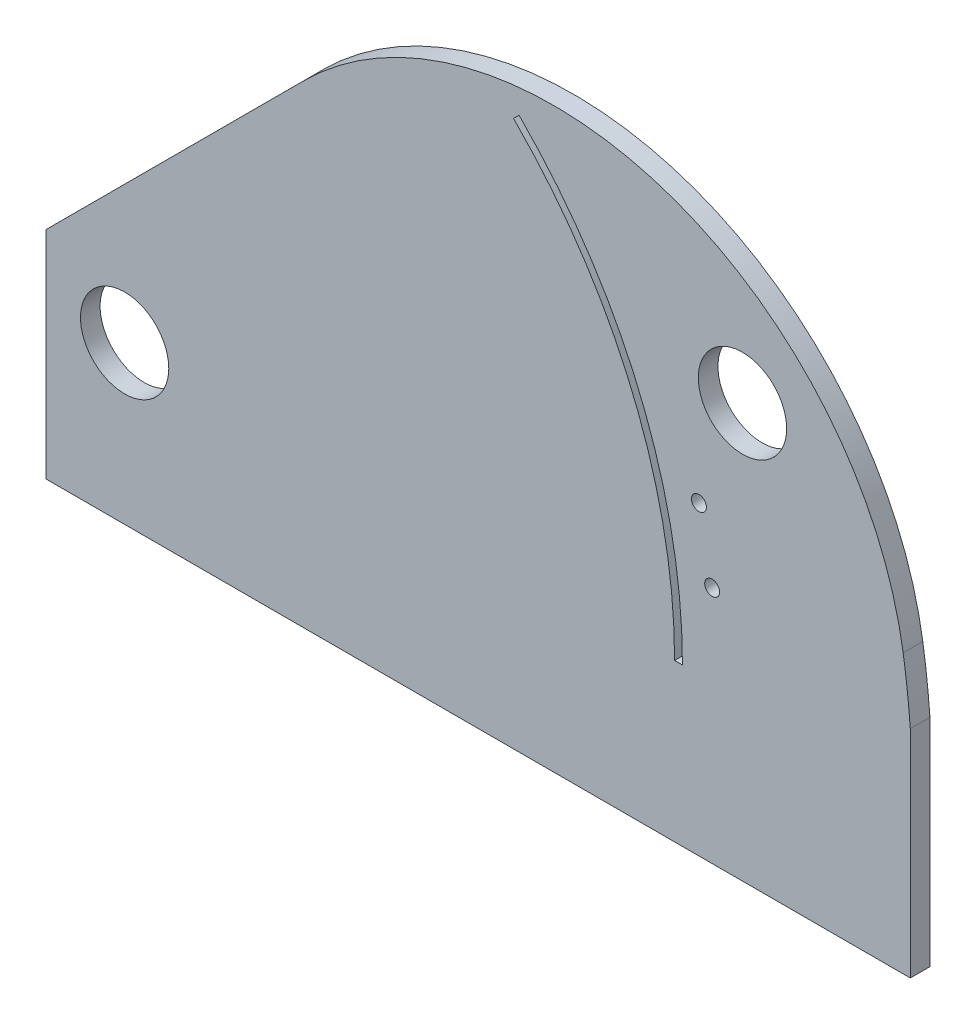
ISO-10303-21;
HEADER;
FILE_DESCRIPTION(('STEP AP214'),'2;1');
FILE_NAME('part.step','',(''),(''),'','','');
FILE_SCHEMA(('AUTOMOTIVE_DESIGN { 1 0 10303 214 1 1 1 1 }'));
ENDSEC;
DATA;
#1=APPLICATION_CONTEXT('core data for automotive mechanical design processes');
#2=APPLICATION_PROTOCOL_DEFINITION('international standard','automotive_design',2000,#1);
#3=PRODUCT_CONTEXT('',#1,'mechanical');
#4=PRODUCT('Part','Part','',(#3));
#5=PRODUCT_RELATED_PRODUCT_CATEGORY('part','',(#4));
#6=PRODUCT_DEFINITION_FORMATION('','',#4);
#7=PRODUCT_DEFINITION_CONTEXT('part definition',#1,'design');
#8=PRODUCT_DEFINITION('design','',#6,#7);
#9=PRODUCT_DEFINITION_SHAPE('','',#8);
#10=(LENGTH_UNIT() NAMED_UNIT(*) SI_UNIT(.MILLI.,.METRE.));
#11=(NAMED_UNIT(*) PLANE_ANGLE_UNIT() SI_UNIT($,.RADIAN.));
#12=(NAMED_UNIT(*) SI_UNIT($,.STERADIAN.) SOLID_ANGLE_UNIT());
#13=UNCERTAINTY_MEASURE_WITH_UNIT(LENGTH_MEASURE(1.E-05),#10,'distance_accuracy_value','');
#14=(GEOMETRIC_REPRESENTATION_CONTEXT(3) GLOBAL_UNCERTAINTY_ASSIGNED_CONTEXT((#13)) GLOBAL_UNIT_ASSIGNED_CONTEXT((#10,
#11,#12)) REPRESENTATION_CONTEXT('',''));
#15=CARTESIAN_POINT('',(0.,0.,0.));
#16=DIRECTION('',(0.,0.,1.));
#17=DIRECTION('',(1.,0.,0.));
#18=AXIS2_PLACEMENT_3D('',#15,#16,#17);
#19=CARTESIAN_POINT('',(0.,0.,6.35));
#20=DIRECTION('',(0.,0.,1.));
#21=DIRECTION('',(1.,0.,0.));
#22=AXIS2_PLACEMENT_3D('',#19,#20,#21);
#23=PLANE('',#22);
#24=CARTESIAN_POINT('',(185.66167299531,48.0153733775204,6.35));
#25=DIRECTION('',(0.,0.,1.));
#26=DIRECTION('',(1.,0.,0.));
#27=AXIS2_PLACEMENT_3D('',#24,#25,#26);
#28=CIRCLE('',#27,2.41299999999999);
#29=CARTESIAN_POINT('',(188.07467299531,48.0153733775204,6.35));
#30=VERTEX_POINT('',#29);
#31=EDGE_CURVE('E424',#30,#30,#28,.T.);
#32=ORIENTED_EDGE('',*,*,#31,.F.);
#33=EDGE_LOOP('',(#32));
#34=FACE_BOUND('',#33,.T.);
#35=CARTESIAN_POINT('',(189.940787605847,26.4240440445931,6.35));
#36=DIRECTION('',(0.,0.,1.));
#37=DIRECTION('',(1.,0.,0.));
#38=AXIS2_PLACEMENT_3D('',#35,#36,#37);
#39=CIRCLE('',#38,2.413);
#40=CARTESIAN_POINT('',(192.353787605847,26.4240440445931,6.35));
#41=VERTEX_POINT('',#40);
#42=EDGE_CURVE('E410',#41,#41,#39,.T.);
#43=ORIENTED_EDGE('',*,*,#42,.F.);
#44=EDGE_LOOP('',(#43));
#45=FACE_BOUND('',#44,.T.);
#46=CARTESIAN_POINT('',(199.741193703078,83.0049467119255,6.35));
#47=DIRECTION('',(0.,0.,1.));
#48=DIRECTION('',(1.,0.,0.));
#49=AXIS2_PLACEMENT_3D('',#46,#47,#48);
#50=CIRCLE('',#49,14.2748);
#51=CARTESIAN_POINT('',(214.015993703078,83.0049467119255,6.35));
#52=VERTEX_POINT('',#51);
#53=EDGE_CURVE('E157',#52,#52,#50,.T.);
#54=ORIENTED_EDGE('',*,*,#53,.F.);
#55=EDGE_LOOP('',(#54));
#56=FACE_BOUND('',#55,.T.);
#57=CARTESIAN_POINT('',(0.,0.,6.35));
#58=DIRECTION('',(0.,0.,-1.));
#59=DIRECTION('',(-1.,0.,0.));
#60=AXIS2_PLACEMENT_3D('',#57,#58,#59);
#61=CIRCLE('',#60,177.8);
#62=CARTESIAN_POINT('',(125.723585694969,125.723585694967,6.35));
#63=VERTEX_POINT('',#62);
#64=CARTESIAN_POINT('',(177.8,0.,6.35));
#65=VERTEX_POINT('',#64);
#66=EDGE_CURVE('E130',#63,#65,#61,.T.);
#67=ORIENTED_EDGE('',*,*,#66,.F.);
#68=DIRECTION('',(-0.707106781186553,-0.707106781186542,0.));
#69=VECTOR('',#68,1.);
#70=CARTESIAN_POINT('',(127.519636919183,127.519636919181,6.35));
#71=LINE('',#70,#69);
#72=CARTESIAN_POINT('',(127.519636919183,127.519636919181,6.35));
#73=VERTEX_POINT('',#72);
#74=EDGE_CURVE('E150',#73,#63,#71,.T.);
#75=ORIENTED_EDGE('',*,*,#74,.F.);
#76=CARTESIAN_POINT('',(0.,0.,6.35));
#77=DIRECTION('',(0.,0.,-1.));
#78=DIRECTION('',(-1.,0.,0.));
#79=AXIS2_PLACEMENT_3D('',#76,#77,#78);
#80=CIRCLE('',#79,180.34);
#81=CARTESIAN_POINT('',(180.34,0.,6.35));
#82=VERTEX_POINT('',#81);
#83=EDGE_CURVE('E154',#73,#82,#80,.T.);
#84=ORIENTED_EDGE('',*,*,#83,.T.);
#85=DIRECTION('',(1.,0.,0.));
#86=VECTOR('',#85,1.);
#87=CARTESIAN_POINT('',(177.8,0.,6.35));
#88=LINE('',#87,#86);
#89=EDGE_CURVE('E166',#65,#82,#88,.T.);
#90=ORIENTED_EDGE('',*,*,#89,.F.);
#91=EDGE_LOOP('',(#67,#75,#84,#90));
#92=FACE_BOUND('',#91,.T.);
#93=CARTESIAN_POINT('',(0.,0.,6.35));
#94=DIRECTION('',(0.,0.,1.));
#95=DIRECTION('',(1.,0.,0.));
#96=AXIS2_PLACEMENT_3D('',#93,#94,#95);
#97=CIRCLE('',#96,254.713373225671);
#98=CARTESIAN_POINT('',(254.,19.05,6.35));
#99=VERTEX_POINT('',#98);
#100=CARTESIAN_POINT('',(251.694377275896,39.100421323805,6.35));
#101=VERTEX_POINT('',#100);
#102=EDGE_CURVE('E201',#99,#101,#97,.T.);
#103=ORIENTED_EDGE('',*,*,#102,.T.);
#104=CARTESIAN_POINT('',(138.749120580848,21.5545104016042,6.35));
#105=DIRECTION('',(0.,0.,1.));
#106=DIRECTION('',(1.,0.,0.));
#107=AXIS2_PLACEMENT_3D('',#104,#105,#106);
#108=CIRCLE('',#107,114.3);
#109=CARTESIAN_POINT('',(57.9268154912253,102.376815491226,6.35));
#110=VERTEX_POINT('',#109);
#111=EDGE_CURVE('E11',#101,#110,#108,.T.);
#112=ORIENTED_EDGE('',*,*,#111,.T.);
#113=DIRECTION('',(-0.707106781186544,-0.707106781186551,0.));
#114=VECTOR('',#113,1.);
#115=CARTESIAN_POINT('',(156.508042901976,200.958042901978,6.35));
#116=LINE('',#115,#114);
#117=CARTESIAN_POINT('',(-25.4,19.05,6.35));
#118=VERTEX_POINT('',#117);
#119=EDGE_CURVE('E204',#110,#118,#116,.T.);
#120=ORIENTED_EDGE('',*,*,#119,.T.);
#121=DIRECTION('',(0.,-1.,0.));
#122=VECTOR('',#121,1.);
#123=CARTESIAN_POINT('',(-25.4,19.05,6.35));
#124=LINE('',#123,#122);
#125=CARTESIAN_POINT('',(-25.4,-50.8,6.35));
#126=VERTEX_POINT('',#125);
#127=EDGE_CURVE('E190',#118,#126,#124,.T.);
#128=ORIENTED_EDGE('',*,*,#127,.T.);
#129=DIRECTION('',(1.,0.,0.));
#130=VECTOR('',#129,1.);
#131=CARTESIAN_POINT('',(-25.4,-50.8,6.35));
#132=LINE('',#131,#130);
#133=CARTESIAN_POINT('',(254.,-50.8,6.35));
#134=VERTEX_POINT('',#133);
#135=EDGE_CURVE('E194',#126,#134,#132,.T.);
#136=ORIENTED_EDGE('',*,*,#135,.T.);
#137=DIRECTION('',(0.,1.,0.));
#138=VECTOR('',#137,1.);
#139=CARTESIAN_POINT('',(254.,-50.8,6.35));
#140=LINE('',#139,#138);
#141=EDGE_CURVE('E198',#134,#99,#140,.T.);
#142=ORIENTED_EDGE('',*,*,#141,.T.);
#143=EDGE_LOOP('',(#103,#112,#120,#128,#136,#142));
#144=FACE_BOUND('',#143,.T.);
#145=CARTESIAN_POINT('',(0.,0.,6.35));
#146=DIRECTION('',(0.,0.,1.));
#147=DIRECTION('',(1.,0.,0.));
#148=AXIS2_PLACEMENT_3D('',#145,#146,#147);
#149=CIRCLE('',#148,14.2748);
#150=CARTESIAN_POINT('',(14.2748,0.,6.35));
#151=VERTEX_POINT('',#150);
#152=EDGE_CURVE('E182',#151,#151,#149,.T.);
#153=ORIENTED_EDGE('',*,*,#152,.F.);
#154=EDGE_LOOP('',(#153));
#155=FACE_BOUND('',#154,.T.);
#156=ADVANCED_FACE('F45',(#34,#45,#56,#92,#144,#155),#23,.T.);
#157=CARTESIAN_POINT('',(0.,0.,0.));
#158=DIRECTION('',(0.,0.,1.));
#159=DIRECTION('',(1.,0.,0.));
#160=AXIS2_PLACEMENT_3D('',#157,#158,#159);
#161=PLANE('',#160);
#162=CARTESIAN_POINT('',(185.66167299531,48.0153733775204,0.));
#163=DIRECTION('',(0.,0.,1.));
#164=DIRECTION('',(1.,0.,0.));
#165=AXIS2_PLACEMENT_3D('',#162,#163,#164);
#166=CIRCLE('',#165,2.41299999999999);
#167=CARTESIAN_POINT('',(188.07467299531,48.0153733775204,0.));
#168=VERTEX_POINT('',#167);
#169=EDGE_CURVE('E416',#168,#168,#166,.T.);
#170=ORIENTED_EDGE('',*,*,#169,.T.);
#171=EDGE_LOOP('',(#170));
#172=FACE_BOUND('',#171,.T.);
#173=CARTESIAN_POINT('',(189.940787605847,26.4240440445931,0.));
#174=DIRECTION('',(0.,0.,1.));
#175=DIRECTION('',(1.,0.,0.));
#176=AXIS2_PLACEMENT_3D('',#173,#174,#175);
#177=CIRCLE('',#176,2.413);
#178=CARTESIAN_POINT('',(192.353787605847,26.4240440445931,0.));
#179=VERTEX_POINT('',#178);
#180=EDGE_CURVE('E413',#179,#179,#177,.T.);
#181=ORIENTED_EDGE('',*,*,#180,.T.);
#182=EDGE_LOOP('',(#181));
#183=FACE_BOUND('',#182,.T.);
#184=CARTESIAN_POINT('',(199.741193703078,83.0049467119255,0.));
#185=DIRECTION('',(0.,0.,1.));
#186=DIRECTION('',(1.,0.,0.));
#187=AXIS2_PLACEMENT_3D('',#184,#185,#186);
#188=CIRCLE('',#187,14.2748);
#189=CARTESIAN_POINT('',(214.015993703078,83.0049467119255,0.));
#190=VERTEX_POINT('',#189);
#191=EDGE_CURVE('E167',#190,#190,#188,.T.);
#192=ORIENTED_EDGE('',*,*,#191,.T.);
#193=EDGE_LOOP('',(#192));
#194=FACE_BOUND('',#193,.T.);
#195=DIRECTION('',(-0.707106781186553,-0.707106781186542,0.));
#196=VECTOR('',#195,1.);
#197=CARTESIAN_POINT('',(127.519636919183,127.519636919181,0.));
#198=LINE('',#197,#196);
#199=CARTESIAN_POINT('',(127.519636919183,127.519636919181,0.));
#200=VERTEX_POINT('',#199);
#201=CARTESIAN_POINT('',(125.723585694969,125.723585694967,0.));
#202=VERTEX_POINT('',#201);
#203=EDGE_CURVE('E136',#200,#202,#198,.T.);
#204=ORIENTED_EDGE('',*,*,#203,.T.);
#205=CARTESIAN_POINT('',(0.,0.,0.));
#206=DIRECTION('',(0.,0.,-1.));
#207=DIRECTION('',(-1.,0.,0.));
#208=AXIS2_PLACEMENT_3D('',#205,#206,#207);
#209=CIRCLE('',#208,177.8);
#210=CARTESIAN_POINT('',(177.8,0.,0.));
#211=VERTEX_POINT('',#210);
#212=EDGE_CURVE('E127',#202,#211,#209,.T.);
#213=ORIENTED_EDGE('',*,*,#212,.T.);
#214=DIRECTION('',(1.,0.,0.));
#215=VECTOR('',#214,1.);
#216=CARTESIAN_POINT('',(177.8,0.,0.));
#217=LINE('',#216,#215);
#218=CARTESIAN_POINT('',(180.34,0.,0.));
#219=VERTEX_POINT('',#218);
#220=EDGE_CURVE('E139',#211,#219,#217,.T.);
#221=ORIENTED_EDGE('',*,*,#220,.T.);
#222=CARTESIAN_POINT('',(0.,0.,0.));
#223=DIRECTION('',(0.,0.,-1.));
#224=DIRECTION('',(-1.,0.,0.));
#225=AXIS2_PLACEMENT_3D('',#222,#223,#224);
#226=CIRCLE('',#225,180.34);
#227=EDGE_CURVE('E145',#200,#219,#226,.T.);
#228=ORIENTED_EDGE('',*,*,#227,.F.);
#229=EDGE_LOOP('',(#204,#213,#221,#228));
#230=FACE_BOUND('',#229,.T.);
#231=DIRECTION('',(-0.707106781186544,-0.707106781186551,0.));
#232=VECTOR('',#231,1.);
#233=CARTESIAN_POINT('',(156.508042901976,200.958042901978,0.));
#234=LINE('',#233,#232);
#235=CARTESIAN_POINT('',(57.9268154912253,102.376815491226,0.));
#236=VERTEX_POINT('',#235);
#237=CARTESIAN_POINT('',(-25.4,19.05,0.));
#238=VERTEX_POINT('',#237);
#239=EDGE_CURVE('E195',#236,#238,#234,.T.);
#240=ORIENTED_EDGE('',*,*,#239,.F.);
#241=CARTESIAN_POINT('',(138.749120580848,21.5545104016042,0.));
#242=DIRECTION('',(0.,0.,1.));
#243=DIRECTION('',(1.,0.,0.));
#244=AXIS2_PLACEMENT_3D('',#241,#242,#243);
#245=CIRCLE('',#244,114.3);
#246=CARTESIAN_POINT('',(251.694377275896,39.100421323805,0.));
#247=VERTEX_POINT('',#246);
#248=EDGE_CURVE('E68',#236,#247,#245,.F.);
#249=ORIENTED_EDGE('',*,*,#248,.T.);
#250=CARTESIAN_POINT('',(0.,0.,0.));
#251=DIRECTION('',(0.,0.,1.));
#252=DIRECTION('',(1.,0.,0.));
#253=AXIS2_PLACEMENT_3D('',#250,#251,#252);
#254=CIRCLE('',#253,254.713373225671);
#255=CARTESIAN_POINT('',(254.,19.05,0.));
#256=VERTEX_POINT('',#255);
#257=EDGE_CURVE('E217',#256,#247,#254,.T.);
#258=ORIENTED_EDGE('',*,*,#257,.F.);
#259=DIRECTION('',(0.,1.,0.));
#260=VECTOR('',#259,1.);
#261=CARTESIAN_POINT('',(254.,-50.8,0.));
#262=LINE('',#261,#260);
#263=CARTESIAN_POINT('',(254.,-50.8,0.));
#264=VERTEX_POINT('',#263);
#265=EDGE_CURVE('E214',#264,#256,#262,.T.);
#266=ORIENTED_EDGE('',*,*,#265,.F.);
#267=DIRECTION('',(1.,0.,0.));
#268=VECTOR('',#267,1.);
#269=CARTESIAN_POINT('',(-25.4,-50.8,0.));
#270=LINE('',#269,#268);
#271=CARTESIAN_POINT('',(-25.4,-50.8,0.));
#272=VERTEX_POINT('',#271);
#273=EDGE_CURVE('E211',#272,#264,#270,.T.);
#274=ORIENTED_EDGE('',*,*,#273,.F.);
#275=DIRECTION('',(0.,-1.,0.));
#276=VECTOR('',#275,1.);
#277=CARTESIAN_POINT('',(-25.4,19.05,0.));
#278=LINE('',#277,#276);
#279=EDGE_CURVE('E186',#238,#272,#278,.T.);
#280=ORIENTED_EDGE('',*,*,#279,.F.);
#281=EDGE_LOOP('',(#240,#249,#258,#266,#274,#280));
#282=FACE_BOUND('',#281,.T.);
#283=CARTESIAN_POINT('',(0.,0.,0.));
#284=DIRECTION('',(0.,0.,1.));
#285=DIRECTION('',(1.,0.,0.));
#286=AXIS2_PLACEMENT_3D('',#283,#284,#285);
#287=CIRCLE('',#286,14.2748);
#288=CARTESIAN_POINT('',(14.2748,0.,0.));
#289=VERTEX_POINT('',#288);
#290=EDGE_CURVE('E176',#289,#289,#287,.T.);
#291=ORIENTED_EDGE('',*,*,#290,.T.);
#292=EDGE_LOOP('',(#291));
#293=FACE_BOUND('',#292,.T.);
#294=ADVANCED_FACE('F147',(#172,#183,#194,#230,#282,#293),#161,.F.);
#295=CARTESIAN_POINT('',(-25.4,19.05,6.35));
#296=DIRECTION('',(1.,0.,0.));
#297=DIRECTION('',(0.,1.,0.));
#298=AXIS2_PLACEMENT_3D('',#295,#296,#297);
#299=PLANE('',#298);
#300=ORIENTED_EDGE('',*,*,#279,.T.);
#301=DIRECTION('',(0.,0.,-1.));
#302=VECTOR('',#301,1.);
#303=CARTESIAN_POINT('',(-25.4,-50.8,6.35));
#304=LINE('',#303,#302);
#305=EDGE_CURVE('E233',#126,#272,#304,.T.);
#306=ORIENTED_EDGE('',*,*,#305,.F.);
#307=ORIENTED_EDGE('',*,*,#127,.F.);
#308=DIRECTION('',(0.,0.,-1.));
#309=VECTOR('',#308,1.);
#310=CARTESIAN_POINT('',(-25.4,19.05,6.35));
#311=LINE('',#310,#309);
#312=EDGE_CURVE('E207',#118,#238,#311,.T.);
#313=ORIENTED_EDGE('',*,*,#312,.T.);
#314=EDGE_LOOP('',(#300,#306,#307,#313));
#315=FACE_BOUND('',#314,.T.);
#316=ADVANCED_FACE('F255',(#315),#299,.F.);
#317=CARTESIAN_POINT('',(-25.4,-50.8,6.35));
#318=DIRECTION('',(0.,1.,0.));
#319=DIRECTION('',(0.,0.,1.));
#320=AXIS2_PLACEMENT_3D('',#317,#318,#319);
#321=PLANE('',#320);
#322=ORIENTED_EDGE('',*,*,#273,.T.);
#323=DIRECTION('',(0.,0.,-1.));
#324=VECTOR('',#323,1.);
#325=CARTESIAN_POINT('',(254.,-50.8,6.35));
#326=LINE('',#325,#324);
#327=EDGE_CURVE('E229',#134,#264,#326,.T.);
#328=ORIENTED_EDGE('',*,*,#327,.F.);
#329=ORIENTED_EDGE('',*,*,#135,.F.);
#330=ORIENTED_EDGE('',*,*,#305,.T.);
#331=EDGE_LOOP('',(#322,#328,#329,#330));
#332=FACE_BOUND('',#331,.T.);
#333=ADVANCED_FACE('F290',(#332),#321,.F.);
#334=CARTESIAN_POINT('',(254.,-50.8,6.35));
#335=DIRECTION('',(-1.,0.,0.));
#336=DIRECTION('',(0.,0.,1.));
#337=AXIS2_PLACEMENT_3D('',#334,#335,#336);
#338=PLANE('',#337);
#339=ORIENTED_EDGE('',*,*,#265,.T.);
#340=DIRECTION('',(0.,0.,-1.));
#341=VECTOR('',#340,1.);
#342=CARTESIAN_POINT('',(254.,19.05,6.35));
#343=LINE('',#342,#341);
#344=EDGE_CURVE('E225',#99,#256,#343,.T.);
#345=ORIENTED_EDGE('',*,*,#344,.F.);
#346=ORIENTED_EDGE('',*,*,#141,.F.);
#347=ORIENTED_EDGE('',*,*,#327,.T.);
#348=EDGE_LOOP('',(#339,#345,#346,#347));
#349=FACE_BOUND('',#348,.T.);
#350=ADVANCED_FACE('F287',(#349),#338,.F.);
#351=CARTESIAN_POINT('',(0.,0.,6.35));
#352=DIRECTION('',(0.,0.,-1.));
#353=DIRECTION('',(-1.,0.,0.));
#354=AXIS2_PLACEMENT_3D('',#351,#352,#353);
#355=CYLINDRICAL_SURFACE('',#354,254.713373225671);
#356=ORIENTED_EDGE('',*,*,#257,.T.);
#357=DIRECTION('',(0.,0.,-1.));
#358=VECTOR('',#357,1.);
#359=CARTESIAN_POINT('',(251.694377275896,39.100421323805,6.35));
#360=LINE('',#359,#358);
#361=EDGE_CURVE('E54',#247,#101,#360,.F.);
#362=ORIENTED_EDGE('',*,*,#361,.T.);
#363=ORIENTED_EDGE('',*,*,#102,.F.);
#364=ORIENTED_EDGE('',*,*,#344,.T.);
#365=EDGE_LOOP('',(#356,#362,#363,#364));
#366=FACE_BOUND('',#365,.T.);
#367=ADVANCED_FACE('F284',(#366),#355,.T.);
#368=CARTESIAN_POINT('',(156.508042901976,200.958042901978,6.35));
#369=DIRECTION('',(0.707106781186551,-0.707106781186544,0.));
#370=DIRECTION('',(0.707106781186544,0.707106781186551,0.));
#371=AXIS2_PLACEMENT_3D('',#368,#369,#370);
#372=PLANE('',#371);
#373=ORIENTED_EDGE('',*,*,#119,.F.);
#374=DIRECTION('',(0.,0.,-1.));
#375=VECTOR('',#374,1.);
#376=CARTESIAN_POINT('',(57.9268154912252,102.376815491226,6.35));
#377=LINE('',#376,#375);
#378=EDGE_CURVE('E237',#110,#236,#377,.T.);
#379=ORIENTED_EDGE('',*,*,#378,.T.);
#380=ORIENTED_EDGE('',*,*,#239,.T.);
#381=ORIENTED_EDGE('',*,*,#312,.F.);
#382=EDGE_LOOP('',(#373,#379,#380,#381));
#383=FACE_BOUND('',#382,.T.);
#384=ADVANCED_FACE('F246',(#383),#372,.F.);
#385=CARTESIAN_POINT('',(0.,0.,6.35));
#386=DIRECTION('',(0.,0.,-1.));
#387=DIRECTION('',(-1.,0.,0.));
#388=AXIS2_PLACEMENT_3D('',#385,#386,#387);
#389=CYLINDRICAL_SURFACE('',#388,14.2748);
#390=ORIENTED_EDGE('',*,*,#152,.T.);
#391=EDGE_LOOP('',(#390));
#392=FACE_BOUND('',#391,.T.);
#393=ORIENTED_EDGE('',*,*,#290,.F.);
#394=EDGE_LOOP('',(#393));
#395=FACE_BOUND('',#394,.T.);
#396=ADVANCED_FACE('F280',(#392,#395),#389,.F.);
#397=CARTESIAN_POINT('',(0.,0.,0.));
#398=DIRECTION('',(0.,0.,1.));
#399=DIRECTION('',(1.,0.,0.));
#400=AXIS2_PLACEMENT_3D('',#397,#398,#399);
#401=CYLINDRICAL_SURFACE('',#400,177.8);
#402=ORIENTED_EDGE('',*,*,#66,.T.);
#403=DIRECTION('',(0.,0.,1.));
#404=VECTOR('',#403,1.);
#405=CARTESIAN_POINT('',(177.8,0.,0.));
#406=LINE('',#405,#404);
#407=EDGE_CURVE('E123',#211,#65,#406,.T.);
#408=ORIENTED_EDGE('',*,*,#407,.F.);
#409=ORIENTED_EDGE('',*,*,#212,.F.);
#410=DIRECTION('',(0.,0.,1.));
#411=VECTOR('',#410,1.);
#412=CARTESIAN_POINT('',(125.723585694969,125.723585694967,0.));
#413=LINE('',#412,#411);
#414=EDGE_CURVE('E173',#202,#63,#413,.T.);
#415=ORIENTED_EDGE('',*,*,#414,.T.);
#416=EDGE_LOOP('',(#402,#408,#409,#415));
#417=FACE_BOUND('',#416,.T.);
#418=ADVANCED_FACE('F125',(#417),#401,.T.);
#419=CARTESIAN_POINT('',(127.519636919183,127.519636919181,0.));
#420=DIRECTION('',(-0.707106781186542,0.707106781186553,0.));
#421=DIRECTION('',(-0.707106781186553,-0.707106781186542,0.));
#422=AXIS2_PLACEMENT_3D('',#419,#420,#421);
#423=PLANE('',#422);
#424=ORIENTED_EDGE('',*,*,#74,.T.);
#425=ORIENTED_EDGE('',*,*,#414,.F.);
#426=ORIENTED_EDGE('',*,*,#203,.F.);
#427=DIRECTION('',(0.,0.,1.));
#428=VECTOR('',#427,1.);
#429=CARTESIAN_POINT('',(127.519636919183,127.519636919181,0.));
#430=LINE('',#429,#428);
#431=EDGE_CURVE('E177',#200,#73,#430,.T.);
#432=ORIENTED_EDGE('',*,*,#431,.T.);
#433=EDGE_LOOP('',(#424,#425,#426,#432));
#434=FACE_BOUND('',#433,.T.);
#435=ADVANCED_FACE('F324',(#434),#423,.F.);
#436=CARTESIAN_POINT('',(0.,0.,0.));
#437=DIRECTION('',(0.,0.,1.));
#438=DIRECTION('',(1.,0.,0.));
#439=AXIS2_PLACEMENT_3D('',#436,#437,#438);
#440=CYLINDRICAL_SURFACE('',#439,180.34);
#441=ORIENTED_EDGE('',*,*,#83,.F.);
#442=ORIENTED_EDGE('',*,*,#431,.F.);
#443=ORIENTED_EDGE('',*,*,#227,.T.);
#444=DIRECTION('',(0.,0.,1.));
#445=VECTOR('',#444,1.);
#446=CARTESIAN_POINT('',(180.34,0.,0.));
#447=LINE('',#446,#445);
#448=EDGE_CURVE('E135',#219,#82,#447,.T.);
#449=ORIENTED_EDGE('',*,*,#448,.T.);
#450=EDGE_LOOP('',(#441,#442,#443,#449));
#451=FACE_BOUND('',#450,.T.);
#452=ADVANCED_FACE('F331',(#451),#440,.F.);
#453=CARTESIAN_POINT('',(177.8,0.,0.));
#454=DIRECTION('',(0.,-1.,0.));
#455=DIRECTION('',(1.,0.,0.));
#456=AXIS2_PLACEMENT_3D('',#453,#454,#455);
#457=PLANE('',#456);
#458=ORIENTED_EDGE('',*,*,#89,.T.);
#459=ORIENTED_EDGE('',*,*,#448,.F.);
#460=ORIENTED_EDGE('',*,*,#220,.F.);
#461=ORIENTED_EDGE('',*,*,#407,.T.);
#462=EDGE_LOOP('',(#458,#459,#460,#461));
#463=FACE_BOUND('',#462,.T.);
#464=ADVANCED_FACE('F140',(#463),#457,.F.);
#465=CARTESIAN_POINT('',(199.741193703078,83.0049467119255,0.));
#466=DIRECTION('',(0.,0.,1.));
#467=DIRECTION('',(1.,0.,0.));
#468=AXIS2_PLACEMENT_3D('',#465,#466,#467);
#469=CYLINDRICAL_SURFACE('',#468,14.2748);
#470=ORIENTED_EDGE('',*,*,#191,.F.);
#471=EDGE_LOOP('',(#470));
#472=FACE_BOUND('',#471,.T.);
#473=ORIENTED_EDGE('',*,*,#53,.T.);
#474=EDGE_LOOP('',(#473));
#475=FACE_BOUND('',#474,.T.);
#476=ADVANCED_FACE('F348',(#472,#475),#469,.F.);
#477=CARTESIAN_POINT('',(189.940787605847,26.4240440445931,0.));
#478=DIRECTION('',(0.,0.,1.));
#479=DIRECTION('',(1.,0.,0.));
#480=AXIS2_PLACEMENT_3D('',#477,#478,#479);
#481=CYLINDRICAL_SURFACE('',#480,2.413);
#482=ORIENTED_EDGE('',*,*,#42,.T.);
#483=EDGE_LOOP('',(#482));
#484=FACE_BOUND('',#483,.T.);
#485=ORIENTED_EDGE('',*,*,#180,.F.);
#486=EDGE_LOOP('',(#485));
#487=FACE_BOUND('',#486,.T.);
#488=ADVANCED_FACE('F266',(#484,#487),#481,.F.);
#489=CARTESIAN_POINT('',(185.66167299531,48.0153733775204,0.));
#490=DIRECTION('',(0.,0.,1.));
#491=DIRECTION('',(1.,0.,0.));
#492=AXIS2_PLACEMENT_3D('',#489,#490,#491);
#493=CYLINDRICAL_SURFACE('',#492,2.41299999999999);
#494=ORIENTED_EDGE('',*,*,#31,.T.);
#495=EDGE_LOOP('',(#494));
#496=FACE_BOUND('',#495,.T.);
#497=ORIENTED_EDGE('',*,*,#169,.F.);
#498=EDGE_LOOP('',(#497));
#499=FACE_BOUND('',#498,.T.);
#500=ADVANCED_FACE('F261',(#496,#499),#493,.F.);
#501=CARTESIAN_POINT('',(138.749120580848,21.5545104016042,6.35));
#502=DIRECTION('',(0.,0.,-1.));
#503=DIRECTION('',(-1.,0.,0.));
#504=AXIS2_PLACEMENT_3D('',#501,#502,#503);
#505=CYLINDRICAL_SURFACE('',#504,114.3);
#506=ORIENTED_EDGE('',*,*,#111,.F.);
#507=ORIENTED_EDGE('',*,*,#361,.F.);
#508=ORIENTED_EDGE('',*,*,#248,.F.);
#509=ORIENTED_EDGE('',*,*,#378,.F.);
#510=EDGE_LOOP('',(#506,#507,#508,#509));
#511=FACE_BOUND('',#510,.T.);
#512=ADVANCED_FACE('F47',(#511),#505,.T.);
#513=CLOSED_SHELL('',(#156,#294,#316,#333,#350,#367,#384,#396,#418,#435,#452,#464,#476,#488,
#500,#512));
#514=MANIFOLD_SOLID_BREP('B2',#513);
#515=ADVANCED_BREP_SHAPE_REPRESENTATION('',(#18,#514),#14);
#516=SHAPE_DEFINITION_REPRESENTATION(#9,#515);
ENDSEC;
END-ISO-10303-21;
